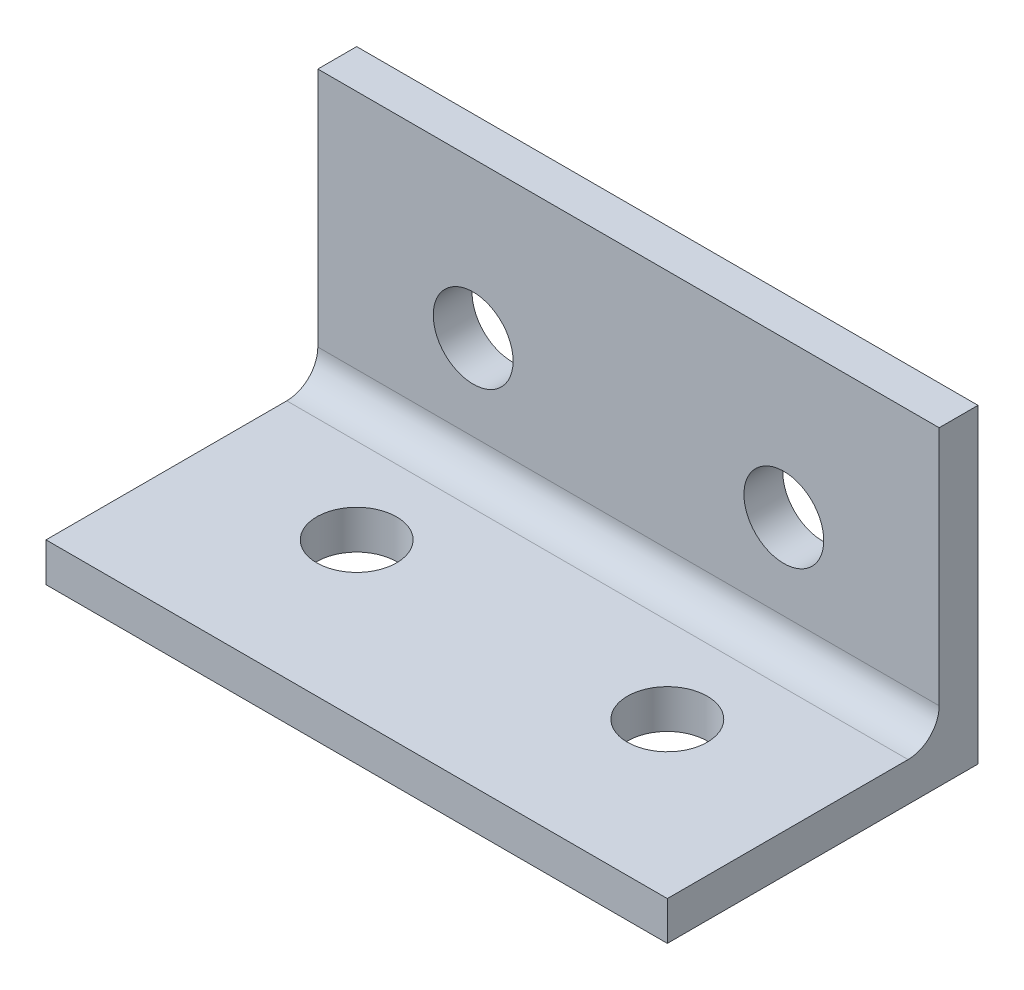
ISO-10303-21;
HEADER;
FILE_DESCRIPTION(('STEP AP214'),'2;1');
FILE_NAME('part.step','',(''),(''),'','','');
FILE_SCHEMA(('AUTOMOTIVE_DESIGN { 1 0 10303 214 1 1 1 1 }'));
ENDSEC;
DATA;
#1=APPLICATION_CONTEXT('core data for automotive mechanical design processes');
#2=APPLICATION_PROTOCOL_DEFINITION('international standard','automotive_design',2000,#1);
#3=PRODUCT_CONTEXT('',#1,'mechanical');
#4=PRODUCT('Part','Part','',(#3));
#5=PRODUCT_RELATED_PRODUCT_CATEGORY('part','',(#4));
#6=PRODUCT_DEFINITION_FORMATION('','',#4);
#7=PRODUCT_DEFINITION_CONTEXT('part definition',#1,'design');
#8=PRODUCT_DEFINITION('design','',#6,#7);
#9=PRODUCT_DEFINITION_SHAPE('','',#8);
#10=(LENGTH_UNIT() NAMED_UNIT(*) SI_UNIT(.MILLI.,.METRE.));
#11=(NAMED_UNIT(*) PLANE_ANGLE_UNIT() SI_UNIT($,.RADIAN.));
#12=(NAMED_UNIT(*) SI_UNIT($,.STERADIAN.) SOLID_ANGLE_UNIT());
#13=UNCERTAINTY_MEASURE_WITH_UNIT(LENGTH_MEASURE(1.E-05),#10,'distance_accuracy_value','');
#14=(GEOMETRIC_REPRESENTATION_CONTEXT(3) GLOBAL_UNCERTAINTY_ASSIGNED_CONTEXT((#13)) GLOBAL_UNIT_ASSIGNED_CONTEXT((#10,
#11,#12)) REPRESENTATION_CONTEXT('',''));
#15=CARTESIAN_POINT('',(0.,0.,0.));
#16=DIRECTION('',(0.,0.,1.));
#17=DIRECTION('',(1.,0.,0.));
#18=AXIS2_PLACEMENT_3D('',#15,#16,#17);
#19=CARTESIAN_POINT('',(0.,3.175,0.));
#20=DIRECTION('',(0.,-1.,0.));
#21=DIRECTION('',(0.,0.,-1.));
#22=AXIS2_PLACEMENT_3D('',#19,#20,#21);
#23=PLANE('',#22);
#24=CARTESIAN_POINT('',(38.1,3.175,-12.7));
#25=DIRECTION('',(0.,1.,0.));
#26=DIRECTION('',(0.,0.,1.));
#27=AXIS2_PLACEMENT_3D('',#24,#25,#26);
#28=CIRCLE('',#27,3.2639);
#29=CARTESIAN_POINT('',(38.1,3.175,-9.4361));
#30=VERTEX_POINT('',#29);
#31=EDGE_CURVE('E130',#30,#30,#28,.T.);
#32=ORIENTED_EDGE('',*,*,#31,.F.);
#33=EDGE_LOOP('',(#32));
#34=FACE_BOUND('',#33,.T.);
#35=CARTESIAN_POINT('',(12.7,3.175,-12.7));
#36=DIRECTION('',(0.,1.,0.));
#37=DIRECTION('',(0.,0.,1.));
#38=AXIS2_PLACEMENT_3D('',#35,#36,#37);
#39=CIRCLE('',#38,3.2639);
#40=CARTESIAN_POINT('',(12.7,3.175,-9.43609999999999));
#41=VERTEX_POINT('',#40);
#42=EDGE_CURVE('E139',#41,#41,#39,.T.);
#43=ORIENTED_EDGE('',*,*,#42,.F.);
#44=EDGE_LOOP('',(#43));
#45=FACE_BOUND('',#44,.T.);
#46=DIRECTION('',(0.,0.,-1.));
#47=VECTOR('',#46,1.);
#48=CARTESIAN_POINT('',(50.8,3.175,-25.4));
#49=LINE('',#48,#47);
#50=CARTESIAN_POINT('',(50.8,3.175,0.));
#51=VERTEX_POINT('',#50);
#52=CARTESIAN_POINT('',(50.8,3.175,-19.685));
#53=VERTEX_POINT('',#52);
#54=EDGE_CURVE('E151',#51,#53,#49,.T.);
#55=ORIENTED_EDGE('',*,*,#54,.T.);
#56=DIRECTION('',(1.,0.,0.));
#57=VECTOR('',#56,1.);
#58=CARTESIAN_POINT('',(0.,3.175,-19.685));
#59=LINE('',#58,#57);
#60=CARTESIAN_POINT('',(0.,3.175,-19.685));
#61=VERTEX_POINT('',#60);
#62=EDGE_CURVE('E61',#53,#61,#59,.F.);
#63=ORIENTED_EDGE('',*,*,#62,.T.);
#64=DIRECTION('',(0.,0.,1.));
#65=VECTOR('',#64,1.);
#66=CARTESIAN_POINT('',(0.,3.175,0.));
#67=LINE('',#66,#65);
#68=CARTESIAN_POINT('',(0.,3.175,0.));
#69=VERTEX_POINT('',#68);
#70=EDGE_CURVE('E155',#61,#69,#67,.T.);
#71=ORIENTED_EDGE('',*,*,#70,.T.);
#72=DIRECTION('',(1.,0.,0.));
#73=VECTOR('',#72,1.);
#74=CARTESIAN_POINT('',(50.8,3.175,0.));
#75=LINE('',#74,#73);
#76=EDGE_CURVE('E147',#69,#51,#75,.T.);
#77=ORIENTED_EDGE('',*,*,#76,.T.);
#78=EDGE_LOOP('',(#55,#63,#71,#77));
#79=FACE_BOUND('',#78,.T.);
#80=ADVANCED_FACE('F39',(#34,#45,#79),#23,.F.);
#81=CARTESIAN_POINT('',(0.,0.,0.));
#82=DIRECTION('',(0.,-1.,0.));
#83=DIRECTION('',(0.,0.,-1.));
#84=AXIS2_PLACEMENT_3D('',#81,#82,#83);
#85=PLANE('',#84);
#86=CARTESIAN_POINT('',(12.7,0.,-12.7));
#87=DIRECTION('',(0.,1.,0.));
#88=DIRECTION('',(0.,0.,1.));
#89=AXIS2_PLACEMENT_3D('',#86,#87,#88);
#90=CIRCLE('',#89,3.2639);
#91=CARTESIAN_POINT('',(12.7,0.,-9.43609999999999));
#92=VERTEX_POINT('',#91);
#93=EDGE_CURVE('E137',#92,#92,#90,.T.);
#94=ORIENTED_EDGE('',*,*,#93,.T.);
#95=EDGE_LOOP('',(#94));
#96=FACE_BOUND('',#95,.T.);
#97=DIRECTION('',(1.,0.,0.));
#98=VECTOR('',#97,1.);
#99=CARTESIAN_POINT('',(50.8,0.,0.));
#100=LINE('',#99,#98);
#101=CARTESIAN_POINT('',(0.,0.,0.));
#102=VERTEX_POINT('',#101);
#103=CARTESIAN_POINT('',(50.8,0.,0.));
#104=VERTEX_POINT('',#103);
#105=EDGE_CURVE('E143',#102,#104,#100,.T.);
#106=ORIENTED_EDGE('',*,*,#105,.F.);
#107=DIRECTION('',(0.,0.,1.));
#108=VECTOR('',#107,1.);
#109=CARTESIAN_POINT('',(0.,0.,0.));
#110=LINE('',#109,#108);
#111=CARTESIAN_POINT('',(0.,0.,-25.4));
#112=VERTEX_POINT('',#111);
#113=EDGE_CURVE('E152',#112,#102,#110,.T.);
#114=ORIENTED_EDGE('',*,*,#113,.F.);
#115=DIRECTION('',(-1.,0.,0.));
#116=VECTOR('',#115,1.);
#117=CARTESIAN_POINT('',(0.,0.,-25.4));
#118=LINE('',#117,#116);
#119=CARTESIAN_POINT('',(50.8,0.,-25.4));
#120=VERTEX_POINT('',#119);
#121=EDGE_CURVE('E165',#120,#112,#118,.T.);
#122=ORIENTED_EDGE('',*,*,#121,.F.);
#123=DIRECTION('',(0.,0.,-1.));
#124=VECTOR('',#123,1.);
#125=CARTESIAN_POINT('',(50.8,0.,-25.4));
#126=LINE('',#125,#124);
#127=EDGE_CURVE('E162',#104,#120,#126,.T.);
#128=ORIENTED_EDGE('',*,*,#127,.F.);
#129=EDGE_LOOP('',(#106,#114,#122,#128));
#130=FACE_BOUND('',#129,.T.);
#131=CARTESIAN_POINT('',(38.1,0.,-12.7));
#132=DIRECTION('',(0.,1.,0.));
#133=DIRECTION('',(0.,0.,1.));
#134=AXIS2_PLACEMENT_3D('',#131,#132,#133);
#135=CIRCLE('',#134,3.2639);
#136=CARTESIAN_POINT('',(38.1,0.,-9.4361));
#137=VERTEX_POINT('',#136);
#138=EDGE_CURVE('E125',#137,#137,#135,.T.);
#139=ORIENTED_EDGE('',*,*,#138,.T.);
#140=EDGE_LOOP('',(#139));
#141=FACE_BOUND('',#140,.T.);
#142=ADVANCED_FACE('F236',(#96,#130,#141),#85,.T.);
#143=CARTESIAN_POINT('',(50.8,3.175,0.));
#144=DIRECTION('',(0.,0.,-1.));
#145=DIRECTION('',(-1.,0.,0.));
#146=AXIS2_PLACEMENT_3D('',#143,#144,#145);
#147=PLANE('',#146);
#148=ORIENTED_EDGE('',*,*,#105,.T.);
#149=DIRECTION('',(0.,-1.,0.));
#150=VECTOR('',#149,1.);
#151=CARTESIAN_POINT('',(50.8,3.175,0.));
#152=LINE('',#151,#150);
#153=EDGE_CURVE('E180',#51,#104,#152,.T.);
#154=ORIENTED_EDGE('',*,*,#153,.F.);
#155=ORIENTED_EDGE('',*,*,#76,.F.);
#156=DIRECTION('',(0.,-1.,0.));
#157=VECTOR('',#156,1.);
#158=CARTESIAN_POINT('',(0.,3.175,0.));
#159=LINE('',#158,#157);
#160=EDGE_CURVE('E158',#69,#102,#159,.T.);
#161=ORIENTED_EDGE('',*,*,#160,.T.);
#162=EDGE_LOOP('',(#148,#154,#155,#161));
#163=FACE_BOUND('',#162,.T.);
#164=ADVANCED_FACE('F240',(#163),#147,.F.);
#165=CARTESIAN_POINT('',(50.8,3.175,-25.4));
#166=DIRECTION('',(-1.,0.,0.));
#167=DIRECTION('',(0.,0.,1.));
#168=AXIS2_PLACEMENT_3D('',#165,#166,#167);
#169=PLANE('',#168);
#170=ORIENTED_EDGE('',*,*,#127,.T.);
#171=DIRECTION('',(0.,-1.,0.));
#172=VECTOR('',#171,1.);
#173=CARTESIAN_POINT('',(50.8,3.175,-25.4));
#174=LINE('',#173,#172);
#175=CARTESIAN_POINT('',(50.8,25.4,-25.4));
#176=VERTEX_POINT('',#175);
#177=EDGE_CURVE('E176',#176,#120,#174,.T.);
#178=ORIENTED_EDGE('',*,*,#177,.F.);
#179=DIRECTION('',(0.,0.,-1.));
#180=VECTOR('',#179,1.);
#181=CARTESIAN_POINT('',(50.8,25.4,-25.4));
#182=LINE('',#181,#180);
#183=CARTESIAN_POINT('',(50.8,25.4,-22.225));
#184=VERTEX_POINT('',#183);
#185=EDGE_CURVE('E109',#184,#176,#182,.T.);
#186=ORIENTED_EDGE('',*,*,#185,.F.);
#187=DIRECTION('',(0.,-1.,0.));
#188=VECTOR('',#187,1.);
#189=CARTESIAN_POINT('',(50.8,25.4,-22.225));
#190=LINE('',#189,#188);
#191=CARTESIAN_POINT('',(50.8,5.715,-22.225));
#192=VERTEX_POINT('',#191);
#193=EDGE_CURVE('E104',#184,#192,#190,.T.);
#194=ORIENTED_EDGE('',*,*,#193,.T.);
#195=CARTESIAN_POINT('',(50.8,5.715,-19.685));
#196=DIRECTION('',(-1.,0.,0.));
#197=DIRECTION('',(0.,0.,1.));
#198=AXIS2_PLACEMENT_3D('',#195,#196,#197);
#199=CIRCLE('',#198,2.54);
#200=EDGE_CURVE('E48',#192,#53,#199,.T.);
#201=ORIENTED_EDGE('',*,*,#200,.T.);
#202=ORIENTED_EDGE('',*,*,#54,.F.);
#203=ORIENTED_EDGE('',*,*,#153,.T.);
#204=EDGE_LOOP('',(#170,#178,#186,#194,#201,#202,#203));
#205=FACE_BOUND('',#204,.T.);
#206=ADVANCED_FACE('F190',(#205),#169,.F.);
#207=CARTESIAN_POINT('',(0.,3.175,-25.4));
#208=DIRECTION('',(0.,0.,1.));
#209=DIRECTION('',(1.,0.,0.));
#210=AXIS2_PLACEMENT_3D('',#207,#208,#209);
#211=PLANE('',#210);
#212=CARTESIAN_POINT('',(38.1,12.7,-25.4));
#213=DIRECTION('',(0.,0.,1.));
#214=DIRECTION('',(1.,0.,0.));
#215=AXIS2_PLACEMENT_3D('',#212,#213,#214);
#216=CIRCLE('',#215,3.2639);
#217=CARTESIAN_POINT('',(41.3639,12.7,-25.4));
#218=VERTEX_POINT('',#217);
#219=EDGE_CURVE('E120',#218,#218,#216,.T.);
#220=ORIENTED_EDGE('',*,*,#219,.T.);
#221=EDGE_LOOP('',(#220));
#222=FACE_BOUND('',#221,.T.);
#223=CARTESIAN_POINT('',(12.7,12.7,-25.4));
#224=DIRECTION('',(0.,0.,1.));
#225=DIRECTION('',(1.,0.,0.));
#226=AXIS2_PLACEMENT_3D('',#223,#224,#225);
#227=CIRCLE('',#226,3.2639);
#228=CARTESIAN_POINT('',(15.9639,12.7,-25.4));
#229=VERTEX_POINT('',#228);
#230=EDGE_CURVE('E198',#229,#229,#227,.T.);
#231=ORIENTED_EDGE('',*,*,#230,.T.);
#232=EDGE_LOOP('',(#231));
#233=FACE_BOUND('',#232,.T.);
#234=ORIENTED_EDGE('',*,*,#121,.T.);
#235=DIRECTION('',(0.,-1.,0.));
#236=VECTOR('',#235,1.);
#237=CARTESIAN_POINT('',(0.,3.175,-25.4));
#238=LINE('',#237,#236);
#239=CARTESIAN_POINT('',(0.,25.4,-25.4));
#240=VERTEX_POINT('',#239);
#241=EDGE_CURVE('E173',#240,#112,#238,.T.);
#242=ORIENTED_EDGE('',*,*,#241,.F.);
#243=DIRECTION('',(-1.,0.,0.));
#244=VECTOR('',#243,1.);
#245=CARTESIAN_POINT('',(0.,25.4,-25.4));
#246=LINE('',#245,#244);
#247=EDGE_CURVE('E116',#176,#240,#246,.T.);
#248=ORIENTED_EDGE('',*,*,#247,.F.);
#249=ORIENTED_EDGE('',*,*,#177,.T.);
#250=EDGE_LOOP('',(#234,#242,#248,#249));
#251=FACE_BOUND('',#250,.T.);
#252=ADVANCED_FACE('F226',(#222,#233,#251),#211,.F.);
#253=CARTESIAN_POINT('',(0.,3.175,0.));
#254=DIRECTION('',(1.,0.,0.));
#255=DIRECTION('',(0.,0.,-1.));
#256=AXIS2_PLACEMENT_3D('',#253,#254,#255);
#257=PLANE('',#256);
#258=ORIENTED_EDGE('',*,*,#113,.T.);
#259=ORIENTED_EDGE('',*,*,#160,.F.);
#260=ORIENTED_EDGE('',*,*,#70,.F.);
#261=CARTESIAN_POINT('',(0.,5.715,-19.685));
#262=DIRECTION('',(1.,0.,0.));
#263=DIRECTION('',(0.,0.,-1.));
#264=AXIS2_PLACEMENT_3D('',#261,#262,#263);
#265=CIRCLE('',#264,2.54);
#266=CARTESIAN_POINT('',(0.,5.715,-22.225));
#267=VERTEX_POINT('',#266);
#268=EDGE_CURVE('E11',#61,#267,#265,.T.);
#269=ORIENTED_EDGE('',*,*,#268,.T.);
#270=DIRECTION('',(0.,-1.,0.));
#271=VECTOR('',#270,1.);
#272=CARTESIAN_POINT('',(0.,25.4,-22.225));
#273=LINE('',#272,#271);
#274=CARTESIAN_POINT('',(0.,25.4,-22.225));
#275=VERTEX_POINT('',#274);
#276=EDGE_CURVE('E102',#275,#267,#273,.T.);
#277=ORIENTED_EDGE('',*,*,#276,.F.);
#278=DIRECTION('',(0.,0.,1.));
#279=VECTOR('',#278,1.);
#280=CARTESIAN_POINT('',(0.,25.4,-25.4));
#281=LINE('',#280,#279);
#282=EDGE_CURVE('E110',#240,#275,#281,.T.);
#283=ORIENTED_EDGE('',*,*,#282,.F.);
#284=ORIENTED_EDGE('',*,*,#241,.T.);
#285=EDGE_LOOP('',(#258,#259,#260,#269,#277,#283,#284));
#286=FACE_BOUND('',#285,.T.);
#287=ADVANCED_FACE('F122',(#286),#257,.F.);
#288=CARTESIAN_POINT('',(12.7,3.175,-12.7));
#289=DIRECTION('',(0.,-1.,0.));
#290=DIRECTION('',(0.,0.,-1.));
#291=AXIS2_PLACEMENT_3D('',#288,#289,#290);
#292=CYLINDRICAL_SURFACE('',#291,3.2639);
#293=ORIENTED_EDGE('',*,*,#42,.T.);
#294=EDGE_LOOP('',(#293));
#295=FACE_BOUND('',#294,.T.);
#296=ORIENTED_EDGE('',*,*,#93,.F.);
#297=EDGE_LOOP('',(#296));
#298=FACE_BOUND('',#297,.T.);
#299=ADVANCED_FACE('F258',(#295,#298),#292,.F.);
#300=CARTESIAN_POINT('',(38.1,3.175,-12.7));
#301=DIRECTION('',(0.,-1.,0.));
#302=DIRECTION('',(0.,0.,-1.));
#303=AXIS2_PLACEMENT_3D('',#300,#301,#302);
#304=CYLINDRICAL_SURFACE('',#303,3.2639);
#305=ORIENTED_EDGE('',*,*,#31,.T.);
#306=EDGE_LOOP('',(#305));
#307=FACE_BOUND('',#306,.T.);
#308=ORIENTED_EDGE('',*,*,#138,.F.);
#309=EDGE_LOOP('',(#308));
#310=FACE_BOUND('',#309,.T.);
#311=ADVANCED_FACE('F216',(#307,#310),#304,.F.);
#312=CARTESIAN_POINT('',(0.,25.4,-22.225));
#313=DIRECTION('',(0.,0.,-1.));
#314=DIRECTION('',(-1.,0.,0.));
#315=AXIS2_PLACEMENT_3D('',#312,#313,#314);
#316=PLANE('',#315);
#317=CARTESIAN_POINT('',(38.1,12.7,-22.225));
#318=DIRECTION('',(0.,0.,1.));
#319=DIRECTION('',(1.,0.,0.));
#320=AXIS2_PLACEMENT_3D('',#317,#318,#319);
#321=CIRCLE('',#320,3.2639);
#322=CARTESIAN_POINT('',(41.3639,12.7,-22.225));
#323=VERTEX_POINT('',#322);
#324=EDGE_CURVE('E202',#323,#323,#321,.T.);
#325=ORIENTED_EDGE('',*,*,#324,.F.);
#326=EDGE_LOOP('',(#325));
#327=FACE_BOUND('',#326,.T.);
#328=CARTESIAN_POINT('',(12.7,12.7,-22.225));
#329=DIRECTION('',(0.,0.,1.));
#330=DIRECTION('',(1.,0.,0.));
#331=AXIS2_PLACEMENT_3D('',#328,#329,#330);
#332=CIRCLE('',#331,3.2639);
#333=CARTESIAN_POINT('',(15.9639,12.7,-22.225));
#334=VERTEX_POINT('',#333);
#335=EDGE_CURVE('E203',#334,#334,#332,.T.);
#336=ORIENTED_EDGE('',*,*,#335,.F.);
#337=EDGE_LOOP('',(#336));
#338=FACE_BOUND('',#337,.T.);
#339=ORIENTED_EDGE('',*,*,#276,.T.);
#340=DIRECTION('',(1.,0.,0.));
#341=VECTOR('',#340,1.);
#342=CARTESIAN_POINT('',(50.8,5.715,-22.225));
#343=LINE('',#342,#341);
#344=EDGE_CURVE('E184',#267,#192,#343,.T.);
#345=ORIENTED_EDGE('',*,*,#344,.T.);
#346=ORIENTED_EDGE('',*,*,#193,.F.);
#347=DIRECTION('',(1.,0.,0.));
#348=VECTOR('',#347,1.);
#349=CARTESIAN_POINT('',(0.,25.4,-22.225));
#350=LINE('',#349,#348);
#351=EDGE_CURVE('E97',#275,#184,#350,.T.);
#352=ORIENTED_EDGE('',*,*,#351,.F.);
#353=EDGE_LOOP('',(#339,#345,#346,#352));
#354=FACE_BOUND('',#353,.T.);
#355=ADVANCED_FACE('F99',(#327,#338,#354),#316,.F.);
#356=CARTESIAN_POINT('',(0.,25.4,0.));
#357=DIRECTION('',(0.,1.,0.));
#358=DIRECTION('',(0.,0.,1.));
#359=AXIS2_PLACEMENT_3D('',#356,#357,#358);
#360=PLANE('',#359);
#361=ORIENTED_EDGE('',*,*,#282,.T.);
#362=ORIENTED_EDGE('',*,*,#351,.T.);
#363=ORIENTED_EDGE('',*,*,#185,.T.);
#364=ORIENTED_EDGE('',*,*,#247,.T.);
#365=EDGE_LOOP('',(#361,#362,#363,#364));
#366=FACE_BOUND('',#365,.T.);
#367=ADVANCED_FACE('F114',(#366),#360,.T.);
#368=CARTESIAN_POINT('',(12.7,12.7,-44.45));
#369=DIRECTION('',(0.,0.,1.));
#370=DIRECTION('',(1.,0.,0.));
#371=AXIS2_PLACEMENT_3D('',#368,#369,#370);
#372=CYLINDRICAL_SURFACE('',#371,3.2639);
#373=ORIENTED_EDGE('',*,*,#335,.T.);
#374=EDGE_LOOP('',(#373));
#375=FACE_BOUND('',#374,.T.);
#376=ORIENTED_EDGE('',*,*,#230,.F.);
#377=EDGE_LOOP('',(#376));
#378=FACE_BOUND('',#377,.T.);
#379=ADVANCED_FACE('F220',(#375,#378),#372,.F.);
#380=CARTESIAN_POINT('',(38.1,12.7,-44.45));
#381=DIRECTION('',(0.,0.,1.));
#382=DIRECTION('',(1.,0.,0.));
#383=AXIS2_PLACEMENT_3D('',#380,#381,#382);
#384=CYLINDRICAL_SURFACE('',#383,3.2639);
#385=ORIENTED_EDGE('',*,*,#324,.T.);
#386=EDGE_LOOP('',(#385));
#387=FACE_BOUND('',#386,.T.);
#388=ORIENTED_EDGE('',*,*,#219,.F.);
#389=EDGE_LOOP('',(#388));
#390=FACE_BOUND('',#389,.T.);
#391=ADVANCED_FACE('F211',(#387,#390),#384,.F.);
#392=CARTESIAN_POINT('',(0.,5.715,-19.685));
#393=DIRECTION('',(-1.,0.,0.));
#394=DIRECTION('',(0.,0.,1.));
#395=AXIS2_PLACEMENT_3D('',#392,#393,#394);
#396=CYLINDRICAL_SURFACE('',#395,2.54);
#397=ORIENTED_EDGE('',*,*,#268,.F.);
#398=ORIENTED_EDGE('',*,*,#62,.F.);
#399=ORIENTED_EDGE('',*,*,#200,.F.);
#400=ORIENTED_EDGE('',*,*,#344,.F.);
#401=EDGE_LOOP('',(#397,#398,#399,#400));
#402=FACE_BOUND('',#401,.T.);
#403=ADVANCED_FACE('F41',(#402),#396,.F.);
#404=CLOSED_SHELL('',(#80,#142,#164,#206,#252,#287,#299,#311,#355,#367,#379,#391,#403));
#405=MANIFOLD_SOLID_BREP('B2',#404);
#406=ADVANCED_BREP_SHAPE_REPRESENTATION('',(#18,#405),#14);
#407=SHAPE_DEFINITION_REPRESENTATION(#9,#406);
ENDSEC;
END-ISO-10303-21;
